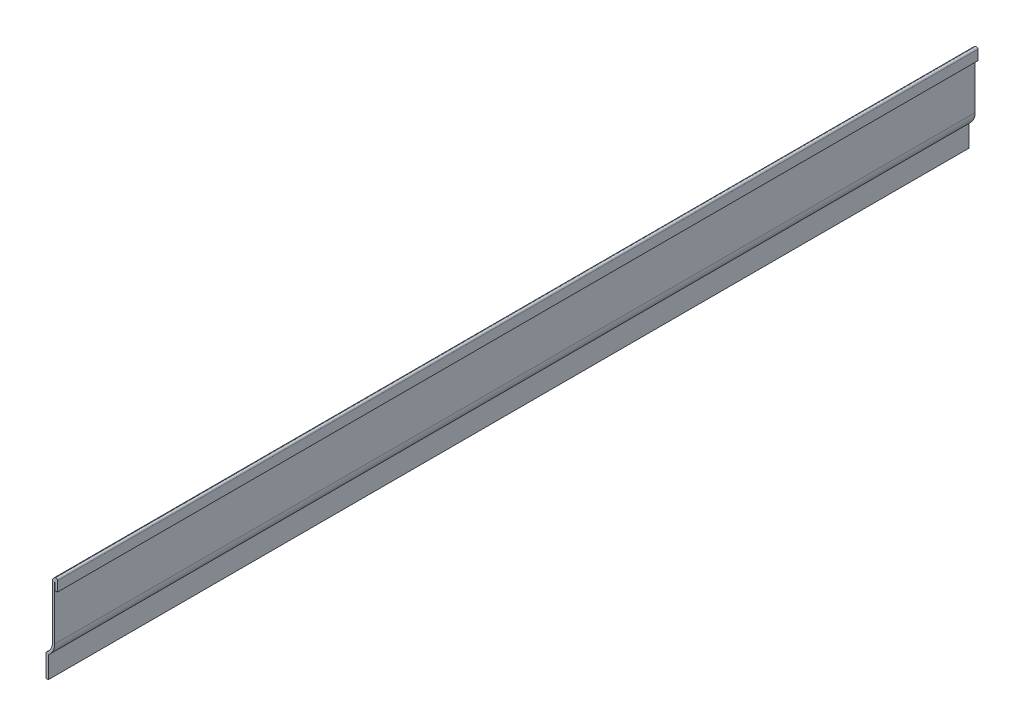
ISO-10303-21;
HEADER;
FILE_DESCRIPTION(('STEP AP214'),'2;1');
FILE_NAME('part.step','',(''),(''),'','','');
FILE_SCHEMA(('AUTOMOTIVE_DESIGN { 1 0 10303 214 1 1 1 1 }'));
ENDSEC;
DATA;
#1=APPLICATION_CONTEXT('core data for automotive mechanical design processes');
#2=APPLICATION_PROTOCOL_DEFINITION('international standard','automotive_design',2000,#1);
#3=PRODUCT_CONTEXT('',#1,'mechanical');
#4=PRODUCT('Part','Part','',(#3));
#5=PRODUCT_RELATED_PRODUCT_CATEGORY('part','',(#4));
#6=PRODUCT_DEFINITION_FORMATION('','',#4);
#7=PRODUCT_DEFINITION_CONTEXT('part definition',#1,'design');
#8=PRODUCT_DEFINITION('design','',#6,#7);
#9=PRODUCT_DEFINITION_SHAPE('','',#8);
#10=(LENGTH_UNIT() NAMED_UNIT(*) SI_UNIT(.MILLI.,.METRE.));
#11=(NAMED_UNIT(*) PLANE_ANGLE_UNIT() SI_UNIT($,.RADIAN.));
#12=(NAMED_UNIT(*) SI_UNIT($,.STERADIAN.) SOLID_ANGLE_UNIT());
#13=UNCERTAINTY_MEASURE_WITH_UNIT(LENGTH_MEASURE(1.E-05),#10,'distance_accuracy_value','');
#14=(GEOMETRIC_REPRESENTATION_CONTEXT(3) GLOBAL_UNCERTAINTY_ASSIGNED_CONTEXT((#13)) GLOBAL_UNIT_ASSIGNED_CONTEXT((#10,
#11,#12)) REPRESENTATION_CONTEXT('',''));
#15=CARTESIAN_POINT('',(0.,0.,0.));
#16=DIRECTION('',(0.,0.,1.));
#17=DIRECTION('',(1.,0.,0.));
#18=AXIS2_PLACEMENT_3D('',#15,#16,#17);
#19=CARTESIAN_POINT('',(-6.35,12.7,-508.));
#20=DIRECTION('',(-1.,0.,0.));
#21=DIRECTION('',(0.,-1.,0.));
#22=AXIS2_PLACEMENT_3D('',#19,#20,#21);
#23=PLANE('',#22);
#24=DIRECTION('',(0.,-1.,0.));
#25=VECTOR('',#24,1.);
#26=CARTESIAN_POINT('',(-6.35,12.7,0.));
#27=LINE('',#26,#25);
#28=CARTESIAN_POINT('',(-6.35,12.0077271507241,0.));
#29=VERTEX_POINT('',#28);
#30=CARTESIAN_POINT('',(-6.35,0.,0.));
#31=VERTEX_POINT('',#30);
#32=EDGE_CURVE('E237',#29,#31,#27,.T.);
#33=ORIENTED_EDGE('',*,*,#32,.F.);
#34=DIRECTION('',(0.,0.,1.));
#35=VECTOR('',#34,1.);
#36=CARTESIAN_POINT('',(-6.35,12.0077271507241,-508.));
#37=LINE('',#36,#35);
#38=CARTESIAN_POINT('',(-6.35,12.0077271507241,-508.));
#39=VERTEX_POINT('',#38);
#40=EDGE_CURVE('E141',#29,#39,#37,.F.);
#41=ORIENTED_EDGE('',*,*,#40,.T.);
#42=DIRECTION('',(0.,-1.,0.));
#43=VECTOR('',#42,1.);
#44=CARTESIAN_POINT('',(-6.35,12.7,-508.));
#45=LINE('',#44,#43);
#46=CARTESIAN_POINT('',(-6.35,0.,-508.));
#47=VERTEX_POINT('',#46);
#48=EDGE_CURVE('E134',#39,#47,#45,.T.);
#49=ORIENTED_EDGE('',*,*,#48,.T.);
#50=DIRECTION('',(0.,0.,1.));
#51=VECTOR('',#50,1.);
#52=CARTESIAN_POINT('',(-6.35,0.,-508.));
#53=LINE('',#52,#51);
#54=EDGE_CURVE('E138',#47,#31,#53,.T.);
#55=ORIENTED_EDGE('',*,*,#54,.T.);
#56=EDGE_LOOP('',(#33,#41,#49,#55));
#57=FACE_BOUND('',#56,.T.);
#58=ADVANCED_FACE('F35',(#57),#23,.T.);
#59=CARTESIAN_POINT('',(-9.93775,18.8774763455638,-508.));
#60=DIRECTION('',(0.,0.,1.));
#61=DIRECTION('',(1.,0.,0.));
#62=AXIS2_PLACEMENT_3D('',#59,#60,#61);
#63=CYLINDRICAL_SURFACE('',#62,7.14375);
#64=CARTESIAN_POINT('',(-9.93775,18.8774763455638,-508.));
#65=DIRECTION('',(0.,0.,-1.));
#66=DIRECTION('',(-1.,0.,0.));
#67=AXIS2_PLACEMENT_3D('',#64,#65,#66);
#68=CIRCLE('',#67,7.14375);
#69=CARTESIAN_POINT('',(-2.794,18.8774763455638,-508.));
#70=VERTEX_POINT('',#69);
#71=CARTESIAN_POINT('',(-5.81324528301887,13.0446704254169,-508.));
#72=VERTEX_POINT('',#71);
#73=EDGE_CURVE('E159',#70,#72,#68,.T.);
#74=ORIENTED_EDGE('',*,*,#73,.T.);
#75=DIRECTION('',(0.,0.,1.));
#76=VECTOR('',#75,1.);
#77=CARTESIAN_POINT('',(-5.81324528301887,13.0446704254169,-508.));
#78=LINE('',#77,#76);
#79=CARTESIAN_POINT('',(-5.81324528301887,13.0446704254169,0.));
#80=VERTEX_POINT('',#79);
#81=EDGE_CURVE('E168',#72,#80,#78,.T.);
#82=ORIENTED_EDGE('',*,*,#81,.T.);
#83=CARTESIAN_POINT('',(-9.93775,18.8774763455638,0.));
#84=DIRECTION('',(0.,0.,-1.));
#85=DIRECTION('',(-1.,0.,0.));
#86=AXIS2_PLACEMENT_3D('',#83,#84,#85);
#87=CIRCLE('',#86,7.14375);
#88=CARTESIAN_POINT('',(-2.794,18.8774763455638,0.));
#89=VERTEX_POINT('',#88);
#90=EDGE_CURVE('E145',#89,#80,#87,.T.);
#91=ORIENTED_EDGE('',*,*,#90,.F.);
#92=DIRECTION('',(0.,0.,1.));
#93=VECTOR('',#92,1.);
#94=CARTESIAN_POINT('',(-2.794,18.8774763455638,-508.));
#95=LINE('',#94,#93);
#96=EDGE_CURVE('E172',#70,#89,#95,.T.);
#97=ORIENTED_EDGE('',*,*,#96,.F.);
#98=EDGE_LOOP('',(#74,#82,#91,#97));
#99=FACE_BOUND('',#98,.T.);
#100=ADVANCED_FACE('F280',(#99),#63,.F.);
#101=CARTESIAN_POINT('',(-2.794,48.4547944652973,-508.));
#102=DIRECTION('',(-1.,0.,0.));
#103=DIRECTION('',(0.,-1.,0.));
#104=AXIS2_PLACEMENT_3D('',#101,#102,#103);
#105=PLANE('',#104);
#106=DIRECTION('',(0.,-1.,0.));
#107=VECTOR('',#106,1.);
#108=CARTESIAN_POINT('',(-2.794,48.4547944652973,0.));
#109=LINE('',#108,#107);
#110=CARTESIAN_POINT('',(-2.794,48.4547944652973,0.));
#111=VERTEX_POINT('',#110);
#112=EDGE_CURVE('E196',#111,#89,#109,.T.);
#113=ORIENTED_EDGE('',*,*,#112,.F.);
#114=DIRECTION('',(0.,0.,1.));
#115=VECTOR('',#114,1.);
#116=CARTESIAN_POINT('',(-2.794,48.4547944652973,-508.));
#117=LINE('',#116,#115);
#118=CARTESIAN_POINT('',(-2.794,48.4547944652973,-508.));
#119=VERTEX_POINT('',#118);
#120=EDGE_CURVE('E207',#119,#111,#117,.T.);
#121=ORIENTED_EDGE('',*,*,#120,.F.);
#122=DIRECTION('',(0.,-1.,0.));
#123=VECTOR('',#122,1.);
#124=CARTESIAN_POINT('',(-2.794,48.4547944652973,-508.));
#125=LINE('',#124,#123);
#126=EDGE_CURVE('E164',#119,#70,#125,.T.);
#127=ORIENTED_EDGE('',*,*,#126,.T.);
#128=ORIENTED_EDGE('',*,*,#96,.T.);
#129=EDGE_LOOP('',(#113,#121,#127,#128));
#130=FACE_BOUND('',#129,.T.);
#131=ADVANCED_FACE('F285',(#130),#105,.T.);
#132=CARTESIAN_POINT('',(-0.41275,48.4547944652973,-508.));
#133=DIRECTION('',(0.,0.,1.));
#134=DIRECTION('',(1.,0.,0.));
#135=AXIS2_PLACEMENT_3D('',#132,#133,#134);
#136=CYLINDRICAL_SURFACE('',#135,2.38125);
#137=CARTESIAN_POINT('',(-0.41275,48.4547944652973,0.));
#138=DIRECTION('',(0.,0.,1.));
#139=DIRECTION('',(-1.,0.,0.));
#140=AXIS2_PLACEMENT_3D('',#137,#138,#139);
#141=CIRCLE('',#140,2.38125);
#142=CARTESIAN_POINT('',(-1.17272340425532,50.7115159783167,0.));
#143=VERTEX_POINT('',#142);
#144=EDGE_CURVE('E194',#143,#111,#141,.T.);
#145=ORIENTED_EDGE('',*,*,#144,.F.);
#146=DIRECTION('',(0.,0.,1.));
#147=VECTOR('',#146,1.);
#148=CARTESIAN_POINT('',(-1.17272340425532,50.7115159783167,-508.));
#149=LINE('',#148,#147);
#150=CARTESIAN_POINT('',(-1.17272340425532,50.7115159783167,-508.));
#151=VERTEX_POINT('',#150);
#152=EDGE_CURVE('E43',#143,#151,#149,.F.);
#153=ORIENTED_EDGE('',*,*,#152,.T.);
#154=CARTESIAN_POINT('',(-0.41275,48.4547944652973,-508.));
#155=DIRECTION('',(0.,0.,1.));
#156=DIRECTION('',(-1.,0.,0.));
#157=AXIS2_PLACEMENT_3D('',#154,#155,#156);
#158=CIRCLE('',#157,2.38125);
#159=EDGE_CURVE('E271',#151,#119,#158,.T.);
#160=ORIENTED_EDGE('',*,*,#159,.T.);
#161=ORIENTED_EDGE('',*,*,#120,.T.);
#162=EDGE_LOOP('',(#145,#153,#160,#161));
#163=FACE_BOUND('',#162,.T.);
#164=ADVANCED_FACE('F315',(#163),#136,.T.);
#165=CARTESIAN_POINT('',(0.,44.45,-508.));
#166=DIRECTION('',(1.,0.,0.));
#167=DIRECTION('',(0.,0.,-1.));
#168=AXIS2_PLACEMENT_3D('',#165,#166,#167);
#169=PLANE('',#168);
#170=DIRECTION('',(0.,1.,0.));
#171=VECTOR('',#170,1.);
#172=CARTESIAN_POINT('',(0.,44.45,-508.));
#173=LINE('',#172,#171);
#174=CARTESIAN_POINT('',(0.,44.45,-508.));
#175=VERTEX_POINT('',#174);
#176=CARTESIAN_POINT('',(0.,49.8690066134562,-508.));
#177=VERTEX_POINT('',#176);
#178=EDGE_CURVE('E187',#175,#177,#173,.T.);
#179=ORIENTED_EDGE('',*,*,#178,.T.);
#180=DIRECTION('',(0.,0.,1.));
#181=VECTOR('',#180,1.);
#182=CARTESIAN_POINT('',(0.,49.8690066134562,-508.));
#183=LINE('',#182,#181);
#184=CARTESIAN_POINT('',(0.,49.8690066134562,0.));
#185=VERTEX_POINT('',#184);
#186=EDGE_CURVE('E177',#177,#185,#183,.T.);
#187=ORIENTED_EDGE('',*,*,#186,.T.);
#188=DIRECTION('',(0.,1.,0.));
#189=VECTOR('',#188,1.);
#190=CARTESIAN_POINT('',(0.,44.45,0.));
#191=LINE('',#190,#189);
#192=CARTESIAN_POINT('',(0.,44.45,0.));
#193=VERTEX_POINT('',#192);
#194=EDGE_CURVE('E185',#193,#185,#191,.T.);
#195=ORIENTED_EDGE('',*,*,#194,.F.);
#196=DIRECTION('',(0.,0.,1.));
#197=VECTOR('',#196,1.);
#198=CARTESIAN_POINT('',(0.,44.45,-508.));
#199=LINE('',#198,#197);
#200=EDGE_CURVE('E210',#175,#193,#199,.T.);
#201=ORIENTED_EDGE('',*,*,#200,.F.);
#202=EDGE_LOOP('',(#179,#187,#195,#201));
#203=FACE_BOUND('',#202,.T.);
#204=ADVANCED_FACE('F184',(#203),#169,.T.);
#205=CARTESIAN_POINT('',(0.,44.45,-508.));
#206=DIRECTION('',(0.,1.,0.));
#207=DIRECTION('',(0.,0.,1.));
#208=AXIS2_PLACEMENT_3D('',#205,#206,#207);
#209=PLANE('',#208);
#210=DIRECTION('',(-1.,0.,0.));
#211=VECTOR('',#210,1.);
#212=CARTESIAN_POINT('',(0.,44.45,0.));
#213=LINE('',#212,#211);
#214=CARTESIAN_POINT('',(-1.27,44.45,0.));
#215=VERTEX_POINT('',#214);
#216=EDGE_CURVE('E193',#193,#215,#213,.T.);
#217=ORIENTED_EDGE('',*,*,#216,.T.);
#218=DIRECTION('',(0.,0.,1.));
#219=VECTOR('',#218,1.);
#220=CARTESIAN_POINT('',(-1.27,44.45,-508.));
#221=LINE('',#220,#219);
#222=CARTESIAN_POINT('',(-1.27,44.45,-508.));
#223=VERTEX_POINT('',#222);
#224=EDGE_CURVE('E212',#223,#215,#221,.T.);
#225=ORIENTED_EDGE('',*,*,#224,.F.);
#226=DIRECTION('',(-1.,0.,0.));
#227=VECTOR('',#226,1.);
#228=CARTESIAN_POINT('',(0.,44.45,-508.));
#229=LINE('',#228,#227);
#230=EDGE_CURVE('E268',#175,#223,#229,.T.);
#231=ORIENTED_EDGE('',*,*,#230,.F.);
#232=ORIENTED_EDGE('',*,*,#200,.T.);
#233=EDGE_LOOP('',(#217,#225,#231,#232));
#234=FACE_BOUND('',#233,.T.);
#235=ADVANCED_FACE('F309',(#234),#209,.F.);
#236=CARTESIAN_POINT('',(-1.27,44.45,-508.));
#237=DIRECTION('',(1.,0.,0.));
#238=DIRECTION('',(0.,0.,-1.));
#239=AXIS2_PLACEMENT_3D('',#236,#237,#238);
#240=PLANE('',#239);
#241=DIRECTION('',(0.,1.,0.));
#242=VECTOR('',#241,1.);
#243=CARTESIAN_POINT('',(-1.27,44.45,0.));
#244=LINE('',#243,#242);
#245=CARTESIAN_POINT('',(-1.27,49.1619005393767,0.));
#246=VERTEX_POINT('',#245);
#247=EDGE_CURVE('E198',#215,#246,#244,.T.);
#248=ORIENTED_EDGE('',*,*,#247,.T.);
#249=DIRECTION('',(0.,0.,1.));
#250=VECTOR('',#249,1.);
#251=CARTESIAN_POINT('',(-1.27,49.1619005393767,-508.));
#252=LINE('',#251,#250);
#253=CARTESIAN_POINT('',(-1.27,49.1619005393767,-508.));
#254=VERTEX_POINT('',#253);
#255=EDGE_CURVE('E215',#254,#246,#252,.T.);
#256=ORIENTED_EDGE('',*,*,#255,.F.);
#257=DIRECTION('',(0.,1.,0.));
#258=VECTOR('',#257,1.);
#259=CARTESIAN_POINT('',(-1.27,44.45,-508.));
#260=LINE('',#259,#258);
#261=EDGE_CURVE('E266',#223,#254,#260,.T.);
#262=ORIENTED_EDGE('',*,*,#261,.F.);
#263=ORIENTED_EDGE('',*,*,#224,.T.);
#264=EDGE_LOOP('',(#248,#256,#262,#263));
#265=FACE_BOUND('',#264,.T.);
#266=ADVANCED_FACE('F245',(#265),#240,.F.);
#267=CARTESIAN_POINT('',(-0.41275,48.4547944652973,-508.));
#268=DIRECTION('',(0.,0.,1.));
#269=DIRECTION('',(1.,0.,0.));
#270=AXIS2_PLACEMENT_3D('',#267,#268,#269);
#271=CYLINDRICAL_SURFACE('',#270,1.11125);
#272=CARTESIAN_POINT('',(-0.41275,48.4547944652973,0.));
#273=DIRECTION('',(0.,0.,1.));
#274=DIRECTION('',(1.,0.,0.));
#275=AXIS2_PLACEMENT_3D('',#272,#273,#274);
#276=CIRCLE('',#275,1.11125);
#277=CARTESIAN_POINT('',(-1.524,48.4547944652973,0.));
#278=VERTEX_POINT('',#277);
#279=EDGE_CURVE('E242',#246,#278,#276,.T.);
#280=ORIENTED_EDGE('',*,*,#279,.T.);
#281=DIRECTION('',(0.,0.,1.));
#282=VECTOR('',#281,1.);
#283=CARTESIAN_POINT('',(-1.524,48.4547944652973,-508.));
#284=LINE('',#283,#282);
#285=CARTESIAN_POINT('',(-1.524,48.4547944652973,-508.));
#286=VERTEX_POINT('',#285);
#287=EDGE_CURVE('E218',#286,#278,#284,.T.);
#288=ORIENTED_EDGE('',*,*,#287,.F.);
#289=CARTESIAN_POINT('',(-0.41275,48.4547944652973,-508.));
#290=DIRECTION('',(0.,0.,1.));
#291=DIRECTION('',(1.,0.,0.));
#292=AXIS2_PLACEMENT_3D('',#289,#290,#291);
#293=CIRCLE('',#292,1.11125);
#294=EDGE_CURVE('E253',#254,#286,#293,.T.);
#295=ORIENTED_EDGE('',*,*,#294,.F.);
#296=ORIENTED_EDGE('',*,*,#255,.T.);
#297=EDGE_LOOP('',(#280,#288,#295,#296));
#298=FACE_BOUND('',#297,.T.);
#299=ADVANCED_FACE('F251',(#298),#271,.F.);
#300=CARTESIAN_POINT('',(-1.524,48.4547944652973,-508.));
#301=DIRECTION('',(-1.,0.,0.));
#302=DIRECTION('',(0.,-1.,0.));
#303=AXIS2_PLACEMENT_3D('',#300,#301,#302);
#304=PLANE('',#303);
#305=DIRECTION('',(0.,-1.,0.));
#306=VECTOR('',#305,1.);
#307=CARTESIAN_POINT('',(-1.524,48.4547944652973,0.));
#308=LINE('',#307,#306);
#309=CARTESIAN_POINT('',(-1.524,18.8774763455638,0.));
#310=VERTEX_POINT('',#309);
#311=EDGE_CURVE('E235',#278,#310,#308,.T.);
#312=ORIENTED_EDGE('',*,*,#311,.T.);
#313=DIRECTION('',(0.,0.,1.));
#314=VECTOR('',#313,1.);
#315=CARTESIAN_POINT('',(-1.524,18.8774763455638,-508.));
#316=LINE('',#315,#314);
#317=CARTESIAN_POINT('',(-1.524,18.8774763455638,-508.));
#318=VERTEX_POINT('',#317);
#319=EDGE_CURVE('E221',#318,#310,#316,.T.);
#320=ORIENTED_EDGE('',*,*,#319,.F.);
#321=DIRECTION('',(0.,-1.,0.));
#322=VECTOR('',#321,1.);
#323=CARTESIAN_POINT('',(-1.524,48.4547944652973,-508.));
#324=LINE('',#323,#322);
#325=EDGE_CURVE('E260',#286,#318,#324,.T.);
#326=ORIENTED_EDGE('',*,*,#325,.F.);
#327=ORIENTED_EDGE('',*,*,#287,.T.);
#328=EDGE_LOOP('',(#312,#320,#326,#327));
#329=FACE_BOUND('',#328,.T.);
#330=ADVANCED_FACE('F256',(#329),#304,.F.);
#331=CARTESIAN_POINT('',(-9.93775,18.8774763455638,-508.));
#332=DIRECTION('',(0.,0.,1.));
#333=DIRECTION('',(1.,0.,0.));
#334=AXIS2_PLACEMENT_3D('',#331,#332,#333);
#335=CYLINDRICAL_SURFACE('',#334,8.41375);
#336=CARTESIAN_POINT('',(-9.93775,18.8774763455638,0.));
#337=DIRECTION('',(0.,0.,1.));
#338=DIRECTION('',(1.,0.,0.));
#339=AXIS2_PLACEMENT_3D('',#336,#337,#338);
#340=CIRCLE('',#339,8.41375);
#341=CARTESIAN_POINT('',(-5.08,12.0077271507241,0.));
#342=VERTEX_POINT('',#341);
#343=EDGE_CURVE('E233',#310,#342,#340,.F.);
#344=ORIENTED_EDGE('',*,*,#343,.T.);
#345=DIRECTION('',(0.,0.,1.));
#346=VECTOR('',#345,1.);
#347=CARTESIAN_POINT('',(-5.08,12.0077271507241,-508.));
#348=LINE('',#347,#346);
#349=CARTESIAN_POINT('',(-5.08,12.0077271507241,-508.));
#350=VERTEX_POINT('',#349);
#351=EDGE_CURVE('E161',#350,#342,#348,.T.);
#352=ORIENTED_EDGE('',*,*,#351,.F.);
#353=CARTESIAN_POINT('',(-9.93775,18.8774763455638,-508.));
#354=DIRECTION('',(0.,0.,1.));
#355=DIRECTION('',(1.,0.,0.));
#356=AXIS2_PLACEMENT_3D('',#353,#354,#355);
#357=CIRCLE('',#356,8.41375);
#358=EDGE_CURVE('E259',#318,#350,#357,.F.);
#359=ORIENTED_EDGE('',*,*,#358,.F.);
#360=ORIENTED_EDGE('',*,*,#319,.T.);
#361=EDGE_LOOP('',(#344,#352,#359,#360));
#362=FACE_BOUND('',#361,.T.);
#363=ADVANCED_FACE('F258',(#362),#335,.T.);
#364=CARTESIAN_POINT('',(-5.08,12.7,-508.));
#365=DIRECTION('',(-1.,0.,0.));
#366=DIRECTION('',(0.,-1.,0.));
#367=AXIS2_PLACEMENT_3D('',#364,#365,#366);
#368=PLANE('',#367);
#369=DIRECTION('',(0.,-1.,0.));
#370=VECTOR('',#369,1.);
#371=CARTESIAN_POINT('',(-5.08,12.7,0.));
#372=LINE('',#371,#370);
#373=CARTESIAN_POINT('',(-5.08,0.,0.));
#374=VERTEX_POINT('',#373);
#375=EDGE_CURVE('E228',#342,#374,#372,.T.);
#376=ORIENTED_EDGE('',*,*,#375,.T.);
#377=DIRECTION('',(0.,0.,1.));
#378=VECTOR('',#377,1.);
#379=CARTESIAN_POINT('',(-5.08,0.,-508.));
#380=LINE('',#379,#378);
#381=CARTESIAN_POINT('',(-5.08,0.,-508.));
#382=VERTEX_POINT('',#381);
#383=EDGE_CURVE('E158',#382,#374,#380,.T.);
#384=ORIENTED_EDGE('',*,*,#383,.F.);
#385=DIRECTION('',(0.,-1.,0.));
#386=VECTOR('',#385,1.);
#387=CARTESIAN_POINT('',(-5.08,12.7,-508.));
#388=LINE('',#387,#386);
#389=EDGE_CURVE('E150',#350,#382,#388,.T.);
#390=ORIENTED_EDGE('',*,*,#389,.F.);
#391=ORIENTED_EDGE('',*,*,#351,.T.);
#392=EDGE_LOOP('',(#376,#384,#390,#391));
#393=FACE_BOUND('',#392,.T.);
#394=ADVANCED_FACE('F227',(#393),#368,.F.);
#395=CARTESIAN_POINT('',(-5.08,0.,-508.));
#396=DIRECTION('',(0.,1.,0.));
#397=DIRECTION('',(0.,0.,1.));
#398=AXIS2_PLACEMENT_3D('',#395,#396,#397);
#399=PLANE('',#398);
#400=DIRECTION('',(-1.,0.,0.));
#401=VECTOR('',#400,1.);
#402=CARTESIAN_POINT('',(-5.08,0.,0.));
#403=LINE('',#402,#401);
#404=EDGE_CURVE('E157',#374,#31,#403,.T.);
#405=ORIENTED_EDGE('',*,*,#404,.T.);
#406=ORIENTED_EDGE('',*,*,#54,.F.);
#407=DIRECTION('',(-1.,0.,0.));
#408=VECTOR('',#407,1.);
#409=CARTESIAN_POINT('',(-5.08,0.,-508.));
#410=LINE('',#409,#408);
#411=EDGE_CURVE('E144',#382,#47,#410,.T.);
#412=ORIENTED_EDGE('',*,*,#411,.F.);
#413=ORIENTED_EDGE('',*,*,#383,.T.);
#414=EDGE_LOOP('',(#405,#406,#412,#413));
#415=FACE_BOUND('',#414,.T.);
#416=ADVANCED_FACE('F155',(#415),#399,.F.);
#417=CARTESIAN_POINT('',(-9.93775,18.8774763455638,-508.));
#418=DIRECTION('',(0.,0.,1.));
#419=DIRECTION('',(1.,0.,0.));
#420=AXIS2_PLACEMENT_3D('',#417,#418,#419);
#421=PLANE('',#420);
#422=ORIENTED_EDGE('',*,*,#159,.F.);
#423=CARTESIAN_POINT('',(-0.889,49.8690066134562,-508.));
#424=DIRECTION('',(0.,0.,1.));
#425=DIRECTION('',(1.,0.,0.));
#426=AXIS2_PLACEMENT_3D('',#423,#424,#425);
#427=CIRCLE('',#426,0.889);
#428=EDGE_CURVE('E11',#151,#177,#427,.F.);
#429=ORIENTED_EDGE('',*,*,#428,.T.);
#430=ORIENTED_EDGE('',*,*,#178,.F.);
#431=ORIENTED_EDGE('',*,*,#230,.T.);
#432=ORIENTED_EDGE('',*,*,#261,.T.);
#433=ORIENTED_EDGE('',*,*,#294,.T.);
#434=ORIENTED_EDGE('',*,*,#325,.T.);
#435=ORIENTED_EDGE('',*,*,#358,.T.);
#436=ORIENTED_EDGE('',*,*,#389,.T.);
#437=ORIENTED_EDGE('',*,*,#411,.T.);
#438=ORIENTED_EDGE('',*,*,#48,.F.);
#439=CARTESIAN_POINT('',(-5.08,12.0077271507241,-508.));
#440=DIRECTION('',(0.,0.,1.));
#441=DIRECTION('',(1.,0.,0.));
#442=AXIS2_PLACEMENT_3D('',#439,#440,#441);
#443=CIRCLE('',#442,1.27);
#444=EDGE_CURVE('E175',#39,#72,#443,.F.);
#445=ORIENTED_EDGE('',*,*,#444,.T.);
#446=ORIENTED_EDGE('',*,*,#73,.F.);
#447=ORIENTED_EDGE('',*,*,#126,.F.);
#448=EDGE_LOOP('',(#422,#429,#430,#431,#432,#433,#434,#435,#436,#437,#438,#445,#446,#447));
#449=FACE_BOUND('',#448,.T.);
#450=ADVANCED_FACE('F148',(#449),#421,.F.);
#451=CARTESIAN_POINT('',(-9.93775,18.8774763455638,0.));
#452=DIRECTION('',(0.,0.,1.));
#453=DIRECTION('',(1.,0.,0.));
#454=AXIS2_PLACEMENT_3D('',#451,#452,#453);
#455=PLANE('',#454);
#456=ORIENTED_EDGE('',*,*,#194,.T.);
#457=CARTESIAN_POINT('',(-0.889,49.8690066134562,0.));
#458=DIRECTION('',(0.,0.,1.));
#459=DIRECTION('',(1.,0.,0.));
#460=AXIS2_PLACEMENT_3D('',#457,#458,#459);
#461=CIRCLE('',#460,0.889);
#462=EDGE_CURVE('E57',#185,#143,#461,.T.);
#463=ORIENTED_EDGE('',*,*,#462,.T.);
#464=ORIENTED_EDGE('',*,*,#144,.T.);
#465=ORIENTED_EDGE('',*,*,#112,.T.);
#466=ORIENTED_EDGE('',*,*,#90,.T.);
#467=CARTESIAN_POINT('',(-5.08,12.0077271507241,0.));
#468=DIRECTION('',(0.,0.,1.));
#469=DIRECTION('',(1.,0.,0.));
#470=AXIS2_PLACEMENT_3D('',#467,#468,#469);
#471=CIRCLE('',#470,1.27);
#472=EDGE_CURVE('E171',#80,#29,#471,.T.);
#473=ORIENTED_EDGE('',*,*,#472,.T.);
#474=ORIENTED_EDGE('',*,*,#32,.T.);
#475=ORIENTED_EDGE('',*,*,#404,.F.);
#476=ORIENTED_EDGE('',*,*,#375,.F.);
#477=ORIENTED_EDGE('',*,*,#343,.F.);
#478=ORIENTED_EDGE('',*,*,#311,.F.);
#479=ORIENTED_EDGE('',*,*,#279,.F.);
#480=ORIENTED_EDGE('',*,*,#247,.F.);
#481=ORIENTED_EDGE('',*,*,#216,.F.);
#482=EDGE_LOOP('',(#456,#463,#464,#465,#466,#473,#474,#475,#476,#477,#478,#479,#480,#481));
#483=FACE_BOUND('',#482,.T.);
#484=ADVANCED_FACE('F191',(#483),#455,.T.);
#485=CARTESIAN_POINT('',(-5.08,12.0077271507241,-508.));
#486=DIRECTION('',(0.,0.,1.));
#487=DIRECTION('',(1.,0.,0.));
#488=AXIS2_PLACEMENT_3D('',#485,#486,#487);
#489=CYLINDRICAL_SURFACE('',#488,1.27);
#490=ORIENTED_EDGE('',*,*,#444,.F.);
#491=ORIENTED_EDGE('',*,*,#40,.F.);
#492=ORIENTED_EDGE('',*,*,#472,.F.);
#493=ORIENTED_EDGE('',*,*,#81,.F.);
#494=EDGE_LOOP('',(#490,#491,#492,#493));
#495=FACE_BOUND('',#494,.T.);
#496=ADVANCED_FACE('F275',(#495),#489,.T.);
#497=CARTESIAN_POINT('',(-0.889,49.8690066134562,-508.));
#498=DIRECTION('',(0.,0.,1.));
#499=DIRECTION('',(1.,0.,0.));
#500=AXIS2_PLACEMENT_3D('',#497,#498,#499);
#501=CYLINDRICAL_SURFACE('',#500,0.889);
#502=ORIENTED_EDGE('',*,*,#428,.F.);
#503=ORIENTED_EDGE('',*,*,#152,.F.);
#504=ORIENTED_EDGE('',*,*,#462,.F.);
#505=ORIENTED_EDGE('',*,*,#186,.F.);
#506=EDGE_LOOP('',(#502,#503,#504,#505));
#507=FACE_BOUND('',#506,.T.);
#508=ADVANCED_FACE('F37',(#507),#501,.T.);
#509=CLOSED_SHELL('',(#58,#100,#131,#164,#204,#235,#266,#299,#330,#363,#394,#416,#450,#484,#496,#508));
#510=MANIFOLD_SOLID_BREP('B2',#509);
#511=ADVANCED_BREP_SHAPE_REPRESENTATION('',(#18,#510),#14);
#512=SHAPE_DEFINITION_REPRESENTATION(#9,#511);
ENDSEC;
END-ISO-10303-21;
